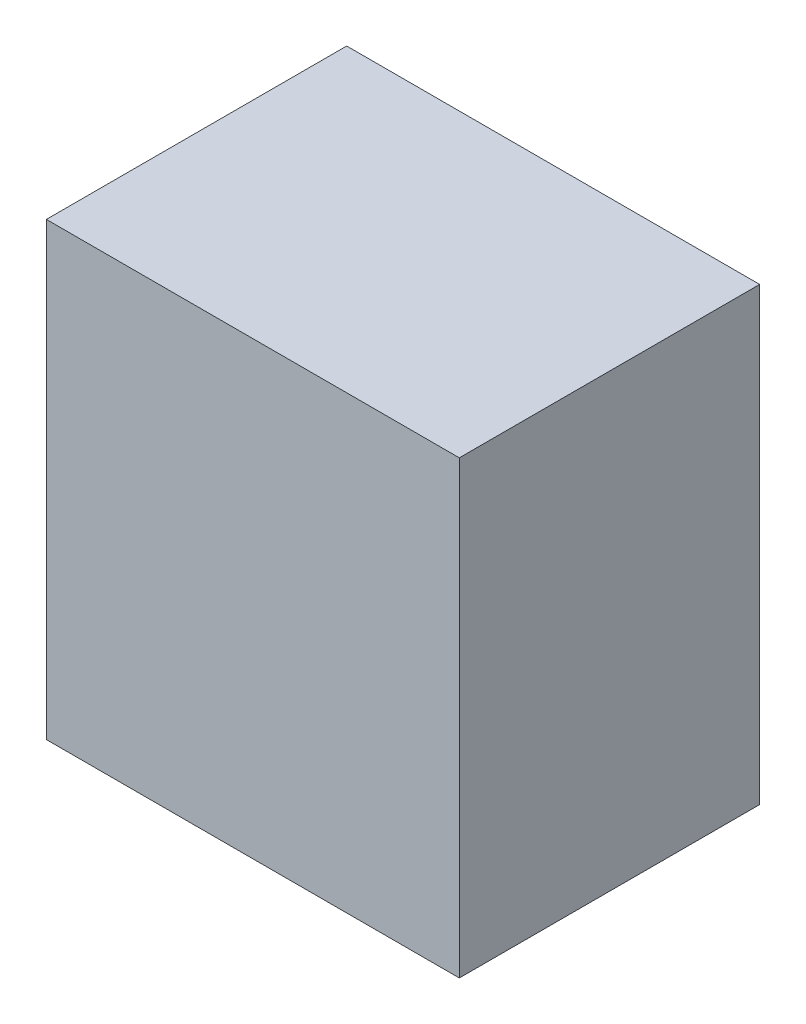
ISO-10303-21;
HEADER;
FILE_DESCRIPTION(('STEP AP214'),'2;1');
FILE_NAME('part.step','',(''),(''),'','','');
FILE_SCHEMA(('AUTOMOTIVE_DESIGN { 1 0 10303 214 1 1 1 1 }'));
ENDSEC;
DATA;
#1=APPLICATION_CONTEXT('core data for automotive mechanical design processes');
#2=APPLICATION_PROTOCOL_DEFINITION('international standard','automotive_design',2000,#1);
#3=PRODUCT_CONTEXT('',#1,'mechanical');
#4=PRODUCT('Part','Part','',(#3));
#5=PRODUCT_RELATED_PRODUCT_CATEGORY('part','',(#4));
#6=PRODUCT_DEFINITION_FORMATION('','',#4);
#7=PRODUCT_DEFINITION_CONTEXT('part definition',#1,'design');
#8=PRODUCT_DEFINITION('design','',#6,#7);
#9=PRODUCT_DEFINITION_SHAPE('','',#8);
#10=(LENGTH_UNIT() NAMED_UNIT(*) SI_UNIT(.MILLI.,.METRE.));
#11=(NAMED_UNIT(*) PLANE_ANGLE_UNIT() SI_UNIT($,.RADIAN.));
#12=(NAMED_UNIT(*) SI_UNIT($,.STERADIAN.) SOLID_ANGLE_UNIT());
#13=UNCERTAINTY_MEASURE_WITH_UNIT(LENGTH_MEASURE(1.E-05),#10,'distance_accuracy_value','');
#14=(GEOMETRIC_REPRESENTATION_CONTEXT(3) GLOBAL_UNCERTAINTY_ASSIGNED_CONTEXT((#13)) GLOBAL_UNIT_ASSIGNED_CONTEXT((#10,
#11,#12)) REPRESENTATION_CONTEXT('',''));
#15=CARTESIAN_POINT('',(0.,0.,0.));
#16=DIRECTION('',(0.,0.,1.));
#17=DIRECTION('',(1.,0.,0.));
#18=AXIS2_PLACEMENT_3D('',#15,#16,#17);
#19=CARTESIAN_POINT('',(0.27500072,0.2999994,0.3999992));
#20=DIRECTION('',(0.,0.,-1.));
#21=DIRECTION('',(-1.,0.,0.));
#22=AXIS2_PLACEMENT_3D('',#19,#20,#21);
#23=PLANE('',#22);
#24=DIRECTION('',(0.,1.,0.));
#25=VECTOR('',#24,1.);
#26=CARTESIAN_POINT('',(-0.27500072,0.2999994,0.3999992));
#27=LINE('',#26,#25);
#28=CARTESIAN_POINT('',(-0.27500072,0.2999994,0.3999992));
#29=VERTEX_POINT('',#28);
#30=CARTESIAN_POINT('',(-0.27500072,-0.2999994,0.3999992));
#31=VERTEX_POINT('',#30);
#32=EDGE_CURVE('E55',#29,#31,#27,.F.);
#33=ORIENTED_EDGE('',*,*,#32,.T.);
#34=DIRECTION('',(1.,0.,0.));
#35=VECTOR('',#34,1.);
#36=CARTESIAN_POINT('',(-0.27500072,-0.2999994,0.3999992));
#37=LINE('',#36,#35);
#38=CARTESIAN_POINT('',(0.27500072,-0.2999994,0.3999992));
#39=VERTEX_POINT('',#38);
#40=EDGE_CURVE('E57',#31,#39,#37,.T.);
#41=ORIENTED_EDGE('',*,*,#40,.T.);
#42=DIRECTION('',(0.,1.,0.));
#43=VECTOR('',#42,1.);
#44=CARTESIAN_POINT('',(0.27500072,-0.2999994,0.3999992));
#45=LINE('',#44,#43);
#46=CARTESIAN_POINT('',(0.27500072,0.2999994,0.3999992));
#47=VERTEX_POINT('',#46);
#48=EDGE_CURVE('E20',#39,#47,#45,.T.);
#49=ORIENTED_EDGE('',*,*,#48,.T.);
#50=DIRECTION('',(1.,0.,0.));
#51=VECTOR('',#50,1.);
#52=CARTESIAN_POINT('',(0.27500072,0.2999994,0.3999992));
#53=LINE('',#52,#51);
#54=EDGE_CURVE('E80',#47,#29,#53,.F.);
#55=ORIENTED_EDGE('',*,*,#54,.T.);
#56=EDGE_LOOP('',(#33,#41,#49,#55));
#57=FACE_BOUND('',#56,.T.);
#58=ADVANCED_FACE('F17',(#57),#23,.F.);
#59=CARTESIAN_POINT('',(0.27500072,-0.2999994,0.));
#60=DIRECTION('',(-1.,0.,0.));
#61=DIRECTION('',(0.,0.,1.));
#62=AXIS2_PLACEMENT_3D('',#59,#60,#61);
#63=PLANE('',#62);
#64=DIRECTION('',(0.,0.,-1.));
#65=VECTOR('',#64,1.);
#66=CARTESIAN_POINT('',(0.27500072,0.2999994,0.));
#67=LINE('',#66,#65);
#68=CARTESIAN_POINT('',(0.27500072,0.2999994,0.));
#69=VERTEX_POINT('',#68);
#70=EDGE_CURVE('E68',#69,#47,#67,.F.);
#71=ORIENTED_EDGE('',*,*,#70,.T.);
#72=ORIENTED_EDGE('',*,*,#48,.F.);
#73=DIRECTION('',(0.,0.,1.));
#74=VECTOR('',#73,1.);
#75=CARTESIAN_POINT('',(0.27500072,-0.2999994,0.));
#76=LINE('',#75,#74);
#77=CARTESIAN_POINT('',(0.27500072,-0.2999994,0.));
#78=VERTEX_POINT('',#77);
#79=EDGE_CURVE('E63',#39,#78,#76,.F.);
#80=ORIENTED_EDGE('',*,*,#79,.T.);
#81=DIRECTION('',(0.,1.,0.));
#82=VECTOR('',#81,1.);
#83=CARTESIAN_POINT('',(0.27500072,0.2999994,0.));
#84=LINE('',#83,#82);
#85=EDGE_CURVE('E83',#69,#78,#84,.F.);
#86=ORIENTED_EDGE('',*,*,#85,.F.);
#87=EDGE_LOOP('',(#71,#72,#80,#86));
#88=FACE_BOUND('',#87,.T.);
#89=ADVANCED_FACE('F65',(#88),#63,.F.);
#90=CARTESIAN_POINT('',(-0.27500072,-0.2999994,0.));
#91=DIRECTION('',(0.,1.,0.));
#92=DIRECTION('',(0.,0.,1.));
#93=AXIS2_PLACEMENT_3D('',#90,#91,#92);
#94=PLANE('',#93);
#95=ORIENTED_EDGE('',*,*,#79,.F.);
#96=ORIENTED_EDGE('',*,*,#40,.F.);
#97=DIRECTION('',(0.,0.,-1.));
#98=VECTOR('',#97,1.);
#99=CARTESIAN_POINT('',(-0.27500072,-0.2999994,0.));
#100=LINE('',#99,#98);
#101=CARTESIAN_POINT('',(-0.27500072,-0.2999994,0.));
#102=VERTEX_POINT('',#101);
#103=EDGE_CURVE('E75',#31,#102,#100,.T.);
#104=ORIENTED_EDGE('',*,*,#103,.T.);
#105=DIRECTION('',(-1.,0.,0.));
#106=VECTOR('',#105,1.);
#107=CARTESIAN_POINT('',(0.27500072,-0.2999994,0.));
#108=LINE('',#107,#106);
#109=EDGE_CURVE('E72',#78,#102,#108,.T.);
#110=ORIENTED_EDGE('',*,*,#109,.F.);
#111=EDGE_LOOP('',(#95,#96,#104,#110));
#112=FACE_BOUND('',#111,.T.);
#113=ADVANCED_FACE('F70',(#112),#94,.F.);
#114=CARTESIAN_POINT('',(-0.27500072,0.2999994,0.));
#115=DIRECTION('',(1.,0.,0.));
#116=DIRECTION('',(0.,0.,-1.));
#117=AXIS2_PLACEMENT_3D('',#114,#115,#116);
#118=PLANE('',#117);
#119=ORIENTED_EDGE('',*,*,#103,.F.);
#120=ORIENTED_EDGE('',*,*,#32,.F.);
#121=DIRECTION('',(0.,0.,-1.));
#122=VECTOR('',#121,1.);
#123=CARTESIAN_POINT('',(-0.27500072,0.2999994,0.));
#124=LINE('',#123,#122);
#125=CARTESIAN_POINT('',(-0.27500072,0.2999994,0.));
#126=VERTEX_POINT('',#125);
#127=EDGE_CURVE('E35',#29,#126,#124,.T.);
#128=ORIENTED_EDGE('',*,*,#127,.T.);
#129=DIRECTION('',(0.,1.,0.));
#130=VECTOR('',#129,1.);
#131=CARTESIAN_POINT('',(-0.27500072,0.2999994,0.));
#132=LINE('',#131,#130);
#133=EDGE_CURVE('E26',#102,#126,#132,.T.);
#134=ORIENTED_EDGE('',*,*,#133,.F.);
#135=EDGE_LOOP('',(#119,#120,#128,#134));
#136=FACE_BOUND('',#135,.T.);
#137=ADVANCED_FACE('F89',(#136),#118,.F.);
#138=CARTESIAN_POINT('',(0.27500072,0.2999994,0.));
#139=DIRECTION('',(0.,-1.,0.));
#140=DIRECTION('',(0.,0.,-1.));
#141=AXIS2_PLACEMENT_3D('',#138,#139,#140);
#142=PLANE('',#141);
#143=ORIENTED_EDGE('',*,*,#127,.F.);
#144=ORIENTED_EDGE('',*,*,#54,.F.);
#145=ORIENTED_EDGE('',*,*,#70,.F.);
#146=DIRECTION('',(-1.,0.,0.));
#147=VECTOR('',#146,1.);
#148=CARTESIAN_POINT('',(0.27500072,0.2999994,0.));
#149=LINE('',#148,#147);
#150=EDGE_CURVE('E11',#126,#69,#149,.F.);
#151=ORIENTED_EDGE('',*,*,#150,.F.);
#152=EDGE_LOOP('',(#143,#144,#145,#151));
#153=FACE_BOUND('',#152,.T.);
#154=ADVANCED_FACE('F91',(#153),#142,.F.);
#155=CARTESIAN_POINT('',(0.27500072,0.2999994,0.));
#156=DIRECTION('',(0.,0.,-1.));
#157=DIRECTION('',(-1.,0.,0.));
#158=AXIS2_PLACEMENT_3D('',#155,#156,#157);
#159=PLANE('',#158);
#160=ORIENTED_EDGE('',*,*,#133,.T.);
#161=ORIENTED_EDGE('',*,*,#150,.T.);
#162=ORIENTED_EDGE('',*,*,#85,.T.);
#163=ORIENTED_EDGE('',*,*,#109,.T.);
#164=EDGE_LOOP('',(#160,#161,#162,#163));
#165=FACE_BOUND('',#164,.T.);
#166=ADVANCED_FACE('F88',(#165),#159,.T.);
#167=CLOSED_SHELL('',(#58,#89,#113,#137,#154,#166));
#168=MANIFOLD_SOLID_BREP('B1',#167);
#169=ADVANCED_BREP_SHAPE_REPRESENTATION('',(#18,#168),#14);
#170=SHAPE_DEFINITION_REPRESENTATION(#9,#169);
ENDSEC;
END-ISO-10303-21;
